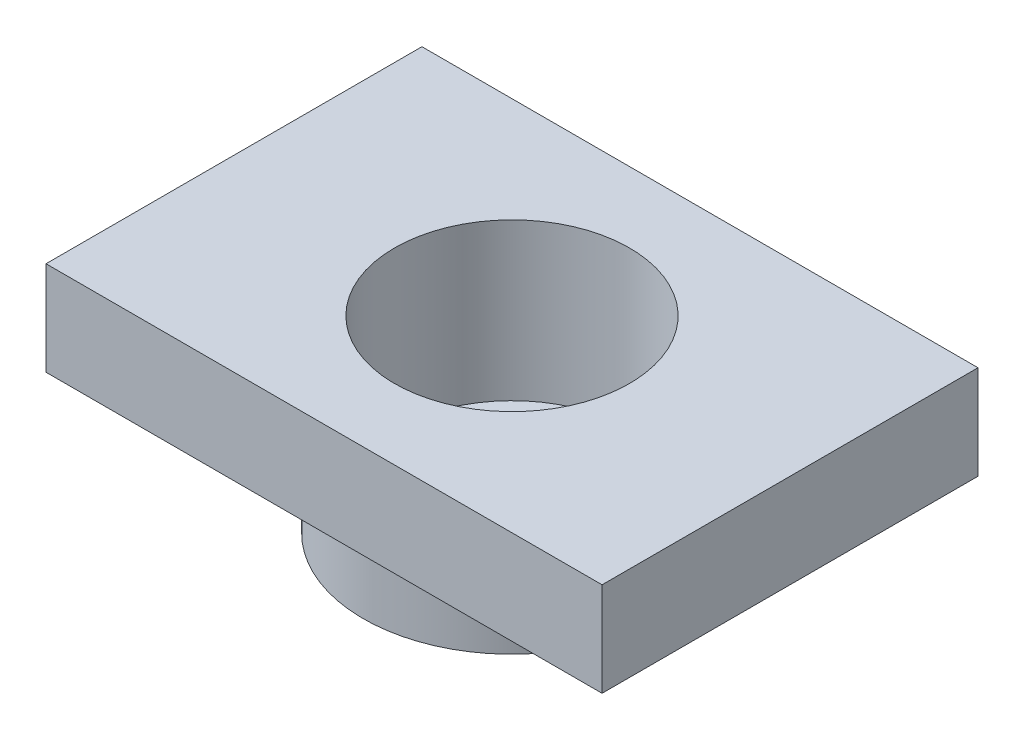
ISO-10303-21;
HEADER;
FILE_DESCRIPTION(('STEP AP214'),'2;1');
FILE_NAME('part.step','',(''),(''),'','','');
FILE_SCHEMA(('AUTOMOTIVE_DESIGN { 1 0 10303 214 1 1 1 1 }'));
ENDSEC;
DATA;
#1=APPLICATION_CONTEXT('core data for automotive mechanical design processes');
#2=APPLICATION_PROTOCOL_DEFINITION('international standard','automotive_design',2000,#1);
#3=PRODUCT_CONTEXT('',#1,'mechanical');
#4=PRODUCT('Part','Part','',(#3));
#5=PRODUCT_RELATED_PRODUCT_CATEGORY('part','',(#4));
#6=PRODUCT_DEFINITION_FORMATION('','',#4);
#7=PRODUCT_DEFINITION_CONTEXT('part definition',#1,'design');
#8=PRODUCT_DEFINITION('design','',#6,#7);
#9=PRODUCT_DEFINITION_SHAPE('','',#8);
#10=(LENGTH_UNIT() NAMED_UNIT(*) SI_UNIT(.MILLI.,.METRE.));
#11=(NAMED_UNIT(*) PLANE_ANGLE_UNIT() SI_UNIT($,.RADIAN.));
#12=(NAMED_UNIT(*) SI_UNIT($,.STERADIAN.) SOLID_ANGLE_UNIT());
#13=UNCERTAINTY_MEASURE_WITH_UNIT(LENGTH_MEASURE(1.E-05),#10,'distance_accuracy_value','');
#14=(GEOMETRIC_REPRESENTATION_CONTEXT(3) GLOBAL_UNCERTAINTY_ASSIGNED_CONTEXT((#13)) GLOBAL_UNIT_ASSIGNED_CONTEXT((#10,
#11,#12)) REPRESENTATION_CONTEXT('',''));
#15=CARTESIAN_POINT('',(0.,0.,0.));
#16=DIRECTION('',(0.,0.,1.));
#17=DIRECTION('',(1.,0.,0.));
#18=AXIS2_PLACEMENT_3D('',#15,#16,#17);
#19=CARTESIAN_POINT('',(59.,0.,0.));
#20=DIRECTION('',(0.,-1.,0.));
#21=DIRECTION('',(1.,0.,0.));
#22=AXIS2_PLACEMENT_3D('',#19,#20,#21);
#23=PLANE('',#22);
#24=CARTESIAN_POINT('',(0.,0.,0.));
#25=DIRECTION('',(0.,1.,0.));
#26=DIRECTION('',(-1.,0.,0.));
#27=AXIS2_PLACEMENT_3D('',#24,#25,#26);
#28=CIRCLE('',#27,15.);
#29=CARTESIAN_POINT('',(-15.,0.,0.));
#30=VERTEX_POINT('',#29);
#31=EDGE_CURVE('E122',#30,#30,#28,.T.);
#32=ORIENTED_EDGE('',*,*,#31,.F.);
#33=EDGE_LOOP('',(#32));
#34=FACE_BOUND('',#33,.T.);
#35=DIRECTION('',(1.,0.,0.));
#36=VECTOR('',#35,1.);
#37=CARTESIAN_POINT('',(35.5,0.,-24.));
#38=LINE('',#37,#36);
#39=CARTESIAN_POINT('',(-35.5000000000001,0.,-24.));
#40=VERTEX_POINT('',#39);
#41=CARTESIAN_POINT('',(35.5,0.,-24.));
#42=VERTEX_POINT('',#41);
#43=EDGE_CURVE('E48',#40,#42,#38,.T.);
#44=ORIENTED_EDGE('',*,*,#43,.F.);
#45=DIRECTION('',(0.,0.,-1.));
#46=VECTOR('',#45,1.);
#47=CARTESIAN_POINT('',(-35.5000000000001,0.,-24.));
#48=LINE('',#47,#46);
#49=CARTESIAN_POINT('',(-35.5000000000001,0.,24.));
#50=VERTEX_POINT('',#49);
#51=EDGE_CURVE('E78',#50,#40,#48,.T.);
#52=ORIENTED_EDGE('',*,*,#51,.F.);
#53=DIRECTION('',(-1.,0.,0.));
#54=VECTOR('',#53,1.);
#55=CARTESIAN_POINT('',(35.5,0.,24.));
#56=LINE('',#55,#54);
#57=CARTESIAN_POINT('',(35.5,0.,24.));
#58=VERTEX_POINT('',#57);
#59=EDGE_CURVE('E85',#58,#50,#56,.T.);
#60=ORIENTED_EDGE('',*,*,#59,.F.);
#61=DIRECTION('',(0.,0.,1.));
#62=VECTOR('',#61,1.);
#63=CARTESIAN_POINT('',(35.5,0.,-24.));
#64=LINE('',#63,#62);
#65=EDGE_CURVE('E90',#42,#58,#64,.T.);
#66=ORIENTED_EDGE('',*,*,#65,.F.);
#67=EDGE_LOOP('',(#44,#52,#60,#66));
#68=FACE_BOUND('',#67,.T.);
#69=ADVANCED_FACE('F32',(#34,#68),#23,.F.);
#70=CARTESIAN_POINT('',(19.,-12.,0.));
#71=DIRECTION('',(0.,1.,0.));
#72=DIRECTION('',(-1.,0.,0.));
#73=AXIS2_PLACEMENT_3D('',#70,#71,#72);
#74=PLANE('',#73);
#75=CARTESIAN_POINT('',(0.,-12.,0.));
#76=DIRECTION('',(0.,1.,0.));
#77=DIRECTION('',(-1.,0.,0.));
#78=AXIS2_PLACEMENT_3D('',#75,#76,#77);
#79=CIRCLE('',#78,19.);
#80=CARTESIAN_POINT('',(-19.,-12.,0.));
#81=VERTEX_POINT('',#80);
#82=EDGE_CURVE('E12',#81,#81,#79,.T.);
#83=ORIENTED_EDGE('',*,*,#82,.T.);
#84=EDGE_LOOP('',(#83));
#85=FACE_BOUND('',#84,.T.);
#86=DIRECTION('',(1.,0.,0.));
#87=VECTOR('',#86,1.);
#88=CARTESIAN_POINT('',(35.5,-12.,-24.));
#89=LINE('',#88,#87);
#90=CARTESIAN_POINT('',(-35.5000000000001,-12.,-24.));
#91=VERTEX_POINT('',#90);
#92=CARTESIAN_POINT('',(35.5,-12.,-24.));
#93=VERTEX_POINT('',#92);
#94=EDGE_CURVE('E97',#91,#93,#89,.T.);
#95=ORIENTED_EDGE('',*,*,#94,.T.);
#96=DIRECTION('',(0.,0.,1.));
#97=VECTOR('',#96,1.);
#98=CARTESIAN_POINT('',(35.5,-12.,-24.));
#99=LINE('',#98,#97);
#100=CARTESIAN_POINT('',(35.5,-12.,24.));
#101=VERTEX_POINT('',#100);
#102=EDGE_CURVE('E100',#93,#101,#99,.T.);
#103=ORIENTED_EDGE('',*,*,#102,.T.);
#104=DIRECTION('',(-1.,0.,0.));
#105=VECTOR('',#104,1.);
#106=CARTESIAN_POINT('',(35.5,-12.,24.));
#107=LINE('',#106,#105);
#108=CARTESIAN_POINT('',(-35.5000000000001,-12.,24.));
#109=VERTEX_POINT('',#108);
#110=EDGE_CURVE('E56',#101,#109,#107,.T.);
#111=ORIENTED_EDGE('',*,*,#110,.T.);
#112=DIRECTION('',(0.,0.,-1.));
#113=VECTOR('',#112,1.);
#114=CARTESIAN_POINT('',(-35.5000000000001,-12.,-24.));
#115=LINE('',#114,#113);
#116=EDGE_CURVE('E80',#109,#91,#115,.T.);
#117=ORIENTED_EDGE('',*,*,#116,.T.);
#118=EDGE_LOOP('',(#95,#103,#111,#117));
#119=FACE_BOUND('',#118,.T.);
#120=ADVANCED_FACE('F162',(#85,#119),#74,.F.);
#121=CARTESIAN_POINT('',(0.,0.,0.));
#122=DIRECTION('',(0.,1.,0.));
#123=DIRECTION('',(-1.,0.,0.));
#124=AXIS2_PLACEMENT_3D('',#121,#122,#123);
#125=CYLINDRICAL_SURFACE('',#124,19.);
#126=ORIENTED_EDGE('',*,*,#82,.F.);
#127=EDGE_LOOP('',(#126));
#128=FACE_BOUND('',#127,.T.);
#129=CARTESIAN_POINT('',(0.,-24.,0.));
#130=DIRECTION('',(0.,1.,0.));
#131=DIRECTION('',(-1.,0.,0.));
#132=AXIS2_PLACEMENT_3D('',#129,#130,#131);
#133=CIRCLE('',#132,19.);
#134=CARTESIAN_POINT('',(-19.,-24.,0.));
#135=VERTEX_POINT('',#134);
#136=EDGE_CURVE('E40',#135,#135,#133,.T.);
#137=ORIENTED_EDGE('',*,*,#136,.T.);
#138=EDGE_LOOP('',(#137));
#139=FACE_BOUND('',#138,.T.);
#140=ADVANCED_FACE('F167',(#128,#139),#125,.T.);
#141=CARTESIAN_POINT('',(9.,-24.,0.));
#142=DIRECTION('',(0.,1.,0.));
#143=DIRECTION('',(-1.,0.,0.));
#144=AXIS2_PLACEMENT_3D('',#141,#142,#143);
#145=PLANE('',#144);
#146=CARTESIAN_POINT('',(-12.9999999999998,-24.,-1.81557108488227E-13));
#147=DIRECTION('',(0.,-1.,0.));
#148=DIRECTION('',(1.,0.,0.));
#149=AXIS2_PLACEMENT_3D('',#146,#147,#148);
#150=CIRCLE('',#149,1.50000000000036);
#151=CARTESIAN_POINT('',(-11.4999999999995,-24.,-1.81557108488227E-13));
#152=VERTEX_POINT('',#151);
#153=EDGE_CURVE('E105',#152,#152,#150,.T.);
#154=ORIENTED_EDGE('',*,*,#153,.F.);
#155=EDGE_LOOP('',(#154));
#156=FACE_BOUND('',#155,.T.);
#157=CARTESIAN_POINT('',(2.7968506284591E-13,-24.,-12.9999999999999));
#158=DIRECTION('',(0.,-1.,0.));
#159=DIRECTION('',(1.,0.,0.));
#160=AXIS2_PLACEMENT_3D('',#157,#158,#159);
#161=CIRCLE('',#160,1.50000000000038);
#162=CARTESIAN_POINT('',(1.50000000000066,-24.,-12.9999999999999));
#163=VERTEX_POINT('',#162);
#164=EDGE_CURVE('E110',#163,#163,#161,.T.);
#165=ORIENTED_EDGE('',*,*,#164,.F.);
#166=EDGE_LOOP('',(#165));
#167=FACE_BOUND('',#166,.T.);
#168=CARTESIAN_POINT('',(13.,-24.,0.));
#169=DIRECTION('',(0.,-1.,0.));
#170=DIRECTION('',(1.,0.,0.));
#171=AXIS2_PLACEMENT_3D('',#168,#169,#170);
#172=CIRCLE('',#171,1.5);
#173=CARTESIAN_POINT('',(14.5,-24.,0.));
#174=VERTEX_POINT('',#173);
#175=EDGE_CURVE('E114',#174,#174,#172,.T.);
#176=ORIENTED_EDGE('',*,*,#175,.F.);
#177=EDGE_LOOP('',(#176));
#178=FACE_BOUND('',#177,.T.);
#179=CARTESIAN_POINT('',(0.,-24.,13.));
#180=DIRECTION('',(0.,-1.,0.));
#181=DIRECTION('',(1.,0.,0.));
#182=AXIS2_PLACEMENT_3D('',#179,#180,#181);
#183=CIRCLE('',#182,1.5);
#184=CARTESIAN_POINT('',(1.5,-24.,13.));
#185=VERTEX_POINT('',#184);
#186=EDGE_CURVE('E118',#185,#185,#183,.T.);
#187=ORIENTED_EDGE('',*,*,#186,.F.);
#188=EDGE_LOOP('',(#187));
#189=FACE_BOUND('',#188,.T.);
#190=ORIENTED_EDGE('',*,*,#136,.F.);
#191=EDGE_LOOP('',(#190));
#192=FACE_BOUND('',#191,.T.);
#193=CARTESIAN_POINT('',(0.,-24.,0.));
#194=DIRECTION('',(0.,1.,0.));
#195=DIRECTION('',(-1.,0.,0.));
#196=AXIS2_PLACEMENT_3D('',#193,#194,#195);
#197=CIRCLE('',#196,9.);
#198=CARTESIAN_POINT('',(-8.99999999999999,-24.,0.));
#199=VERTEX_POINT('',#198);
#200=EDGE_CURVE('E131',#199,#199,#197,.T.);
#201=ORIENTED_EDGE('',*,*,#200,.T.);
#202=EDGE_LOOP('',(#201));
#203=FACE_BOUND('',#202,.T.);
#204=ADVANCED_FACE('F188',(#156,#167,#178,#189,#192,#203),#145,.F.);
#205=CARTESIAN_POINT('',(0.,0.,0.));
#206=DIRECTION('',(0.,1.,0.));
#207=DIRECTION('',(-1.,0.,0.));
#208=AXIS2_PLACEMENT_3D('',#205,#206,#207);
#209=CYLINDRICAL_SURFACE('',#208,9.);
#210=ORIENTED_EDGE('',*,*,#200,.F.);
#211=EDGE_LOOP('',(#210));
#212=FACE_BOUND('',#211,.T.);
#213=CARTESIAN_POINT('',(0.,-20.,0.));
#214=DIRECTION('',(0.,1.,0.));
#215=DIRECTION('',(-1.,0.,0.));
#216=AXIS2_PLACEMENT_3D('',#213,#214,#215);
#217=CIRCLE('',#216,9.);
#218=CARTESIAN_POINT('',(-9.,-20.,0.));
#219=VERTEX_POINT('',#218);
#220=EDGE_CURVE('E128',#219,#219,#217,.T.);
#221=ORIENTED_EDGE('',*,*,#220,.T.);
#222=EDGE_LOOP('',(#221));
#223=FACE_BOUND('',#222,.T.);
#224=ADVANCED_FACE('F181',(#212,#223),#209,.F.);
#225=CARTESIAN_POINT('',(15.,-20.,0.));
#226=DIRECTION('',(0.,-1.,0.));
#227=DIRECTION('',(1.,0.,0.));
#228=AXIS2_PLACEMENT_3D('',#225,#226,#227);
#229=PLANE('',#228);
#230=CARTESIAN_POINT('',(-12.9999999999998,-20.,-1.81557108488227E-13));
#231=DIRECTION('',(0.,-1.,0.));
#232=DIRECTION('',(1.,0.,0.));
#233=AXIS2_PLACEMENT_3D('',#230,#231,#232);
#234=CIRCLE('',#233,1.50000000000036);
#235=CARTESIAN_POINT('',(-11.4999999999995,-20.,-1.81557108488227E-13));
#236=VERTEX_POINT('',#235);
#237=EDGE_CURVE('E35',#236,#236,#234,.T.);
#238=ORIENTED_EDGE('',*,*,#237,.T.);
#239=EDGE_LOOP('',(#238));
#240=FACE_BOUND('',#239,.T.);
#241=CARTESIAN_POINT('',(2.79195204126251E-13,-20.,-12.9999999999999));
#242=DIRECTION('',(0.,-1.,0.));
#243=DIRECTION('',(1.,0.,0.));
#244=AXIS2_PLACEMENT_3D('',#241,#242,#243);
#245=CIRCLE('',#244,1.50000000000038);
#246=CARTESIAN_POINT('',(1.50000000000066,-20.,-12.9999999999999));
#247=VERTEX_POINT('',#246);
#248=EDGE_CURVE('E113',#247,#247,#245,.T.);
#249=ORIENTED_EDGE('',*,*,#248,.T.);
#250=EDGE_LOOP('',(#249));
#251=FACE_BOUND('',#250,.T.);
#252=CARTESIAN_POINT('',(13.,-20.,0.));
#253=DIRECTION('',(0.,-1.,0.));
#254=DIRECTION('',(1.,0.,0.));
#255=AXIS2_PLACEMENT_3D('',#252,#253,#254);
#256=CIRCLE('',#255,1.5);
#257=CARTESIAN_POINT('',(14.5,-20.,0.));
#258=VERTEX_POINT('',#257);
#259=EDGE_CURVE('E117',#258,#258,#256,.T.);
#260=ORIENTED_EDGE('',*,*,#259,.T.);
#261=EDGE_LOOP('',(#260));
#262=FACE_BOUND('',#261,.T.);
#263=CARTESIAN_POINT('',(0.,-20.,13.));
#264=DIRECTION('',(0.,-1.,0.));
#265=DIRECTION('',(1.,0.,0.));
#266=AXIS2_PLACEMENT_3D('',#263,#264,#265);
#267=CIRCLE('',#266,1.5);
#268=CARTESIAN_POINT('',(1.5,-20.,13.));
#269=VERTEX_POINT('',#268);
#270=EDGE_CURVE('E121',#269,#269,#267,.T.);
#271=ORIENTED_EDGE('',*,*,#270,.T.);
#272=EDGE_LOOP('',(#271));
#273=FACE_BOUND('',#272,.T.);
#274=ORIENTED_EDGE('',*,*,#220,.F.);
#275=EDGE_LOOP('',(#274));
#276=FACE_BOUND('',#275,.T.);
#277=CARTESIAN_POINT('',(0.,-20.,0.));
#278=DIRECTION('',(0.,1.,0.));
#279=DIRECTION('',(-1.,0.,0.));
#280=AXIS2_PLACEMENT_3D('',#277,#278,#279);
#281=CIRCLE('',#280,15.);
#282=CARTESIAN_POINT('',(-15.,-20.,0.));
#283=VERTEX_POINT('',#282);
#284=EDGE_CURVE('E125',#283,#283,#281,.T.);
#285=ORIENTED_EDGE('',*,*,#284,.T.);
#286=EDGE_LOOP('',(#285));
#287=FACE_BOUND('',#286,.T.);
#288=ADVANCED_FACE('F142',(#240,#251,#262,#273,#276,#287),#229,.F.);
#289=CARTESIAN_POINT('',(0.,0.,0.));
#290=DIRECTION('',(0.,1.,0.));
#291=DIRECTION('',(-1.,0.,0.));
#292=AXIS2_PLACEMENT_3D('',#289,#290,#291);
#293=CYLINDRICAL_SURFACE('',#292,15.);
#294=ORIENTED_EDGE('',*,*,#284,.F.);
#295=EDGE_LOOP('',(#294));
#296=FACE_BOUND('',#295,.T.);
#297=ORIENTED_EDGE('',*,*,#31,.T.);
#298=EDGE_LOOP('',(#297));
#299=FACE_BOUND('',#298,.T.);
#300=ADVANCED_FACE('F171',(#296,#299),#293,.F.);
#301=CARTESIAN_POINT('',(0.,0.,13.));
#302=DIRECTION('',(0.,-1.,0.));
#303=DIRECTION('',(1.,0.,0.));
#304=AXIS2_PLACEMENT_3D('',#301,#302,#303);
#305=CYLINDRICAL_SURFACE('',#304,1.5);
#306=ORIENTED_EDGE('',*,*,#186,.T.);
#307=EDGE_LOOP('',(#306));
#308=FACE_BOUND('',#307,.T.);
#309=ORIENTED_EDGE('',*,*,#270,.F.);
#310=EDGE_LOOP('',(#309));
#311=FACE_BOUND('',#310,.T.);
#312=ADVANCED_FACE('F158',(#308,#311),#305,.F.);
#313=CARTESIAN_POINT('',(13.,0.,0.));
#314=DIRECTION('',(0.,-1.,0.));
#315=DIRECTION('',(1.,0.,0.));
#316=AXIS2_PLACEMENT_3D('',#313,#314,#315);
#317=CYLINDRICAL_SURFACE('',#316,1.5);
#318=ORIENTED_EDGE('',*,*,#175,.T.);
#319=EDGE_LOOP('',(#318));
#320=FACE_BOUND('',#319,.T.);
#321=ORIENTED_EDGE('',*,*,#259,.F.);
#322=EDGE_LOOP('',(#321));
#323=FACE_BOUND('',#322,.T.);
#324=ADVANCED_FACE('F148',(#320,#323),#317,.F.);
#325=CARTESIAN_POINT('',(2.76745910527956E-13,0.,-12.9999999999999));
#326=DIRECTION('',(0.,-1.,0.));
#327=DIRECTION('',(1.,0.,0.));
#328=AXIS2_PLACEMENT_3D('',#325,#326,#327);
#329=CYLINDRICAL_SURFACE('',#328,1.50000000000038);
#330=ORIENTED_EDGE('',*,*,#164,.T.);
#331=EDGE_LOOP('',(#330));
#332=FACE_BOUND('',#331,.T.);
#333=ORIENTED_EDGE('',*,*,#248,.F.);
#334=EDGE_LOOP('',(#333));
#335=FACE_BOUND('',#334,.T.);
#336=ADVANCED_FACE('F145',(#332,#335),#329,.F.);
#337=CARTESIAN_POINT('',(-12.9999999999998,0.,-1.81557108488227E-13));
#338=DIRECTION('',(0.,-1.,0.));
#339=DIRECTION('',(1.,0.,0.));
#340=AXIS2_PLACEMENT_3D('',#337,#338,#339);
#341=CYLINDRICAL_SURFACE('',#340,1.50000000000036);
#342=ORIENTED_EDGE('',*,*,#153,.T.);
#343=EDGE_LOOP('',(#342));
#344=FACE_BOUND('',#343,.T.);
#345=ORIENTED_EDGE('',*,*,#237,.F.);
#346=EDGE_LOOP('',(#345));
#347=FACE_BOUND('',#346,.T.);
#348=ADVANCED_FACE('F147',(#344,#347),#341,.F.);
#349=CARTESIAN_POINT('',(35.5,0.,-24.));
#350=DIRECTION('',(0.,0.,-1.));
#351=DIRECTION('',(-1.,0.,0.));
#352=AXIS2_PLACEMENT_3D('',#349,#350,#351);
#353=PLANE('',#352);
#354=ORIENTED_EDGE('',*,*,#94,.F.);
#355=DIRECTION('',(0.,-1.,0.));
#356=VECTOR('',#355,1.);
#357=CARTESIAN_POINT('',(-35.5000000000001,0.,-24.));
#358=LINE('',#357,#356);
#359=EDGE_CURVE('E81',#40,#91,#358,.T.);
#360=ORIENTED_EDGE('',*,*,#359,.F.);
#361=ORIENTED_EDGE('',*,*,#43,.T.);
#362=DIRECTION('',(0.,-1.,0.));
#363=VECTOR('',#362,1.);
#364=CARTESIAN_POINT('',(35.5,0.,-24.));
#365=LINE('',#364,#363);
#366=EDGE_CURVE('E92',#42,#93,#365,.T.);
#367=ORIENTED_EDGE('',*,*,#366,.T.);
#368=EDGE_LOOP('',(#354,#360,#361,#367));
#369=FACE_BOUND('',#368,.T.);
#370=ADVANCED_FACE('F155',(#369),#353,.T.);
#371=CARTESIAN_POINT('',(-35.5000000000001,0.,-24.));
#372=DIRECTION('',(-1.,0.,0.));
#373=DIRECTION('',(0.,0.,1.));
#374=AXIS2_PLACEMENT_3D('',#371,#372,#373);
#375=PLANE('',#374);
#376=ORIENTED_EDGE('',*,*,#116,.F.);
#377=DIRECTION('',(0.,-1.,0.));
#378=VECTOR('',#377,1.);
#379=CARTESIAN_POINT('',(-35.5000000000001,0.,24.));
#380=LINE('',#379,#378);
#381=EDGE_CURVE('E74',#50,#109,#380,.T.);
#382=ORIENTED_EDGE('',*,*,#381,.F.);
#383=ORIENTED_EDGE('',*,*,#51,.T.);
#384=ORIENTED_EDGE('',*,*,#359,.T.);
#385=EDGE_LOOP('',(#376,#382,#383,#384));
#386=FACE_BOUND('',#385,.T.);
#387=ADVANCED_FACE('F76',(#386),#375,.T.);
#388=CARTESIAN_POINT('',(35.5,0.,24.));
#389=DIRECTION('',(0.,0.,1.));
#390=DIRECTION('',(1.,0.,0.));
#391=AXIS2_PLACEMENT_3D('',#388,#389,#390);
#392=PLANE('',#391);
#393=ORIENTED_EDGE('',*,*,#110,.F.);
#394=DIRECTION('',(0.,-1.,0.));
#395=VECTOR('',#394,1.);
#396=CARTESIAN_POINT('',(35.5,0.,24.));
#397=LINE('',#396,#395);
#398=EDGE_CURVE('E82',#58,#101,#397,.T.);
#399=ORIENTED_EDGE('',*,*,#398,.F.);
#400=ORIENTED_EDGE('',*,*,#59,.T.);
#401=ORIENTED_EDGE('',*,*,#381,.T.);
#402=EDGE_LOOP('',(#393,#399,#400,#401));
#403=FACE_BOUND('',#402,.T.);
#404=ADVANCED_FACE('F86',(#403),#392,.T.);
#405=CARTESIAN_POINT('',(35.5,0.,-24.));
#406=DIRECTION('',(1.,0.,0.));
#407=DIRECTION('',(0.,0.,-1.));
#408=AXIS2_PLACEMENT_3D('',#405,#406,#407);
#409=PLANE('',#408);
#410=ORIENTED_EDGE('',*,*,#102,.F.);
#411=ORIENTED_EDGE('',*,*,#366,.F.);
#412=ORIENTED_EDGE('',*,*,#65,.T.);
#413=ORIENTED_EDGE('',*,*,#398,.T.);
#414=EDGE_LOOP('',(#410,#411,#412,#413));
#415=FACE_BOUND('',#414,.T.);
#416=ADVANCED_FACE('F211',(#415),#409,.T.);
#417=CLOSED_SHELL('',(#69,#120,#140,#204,#224,#288,#300,#312,#324,#336,#348,#370,#387,#404,#416));
#418=MANIFOLD_SOLID_BREP('B2',#417);
#419=ADVANCED_BREP_SHAPE_REPRESENTATION('',(#18,#418),#14);
#420=SHAPE_DEFINITION_REPRESENTATION(#9,#419);
ENDSEC;
END-ISO-10303-21;
